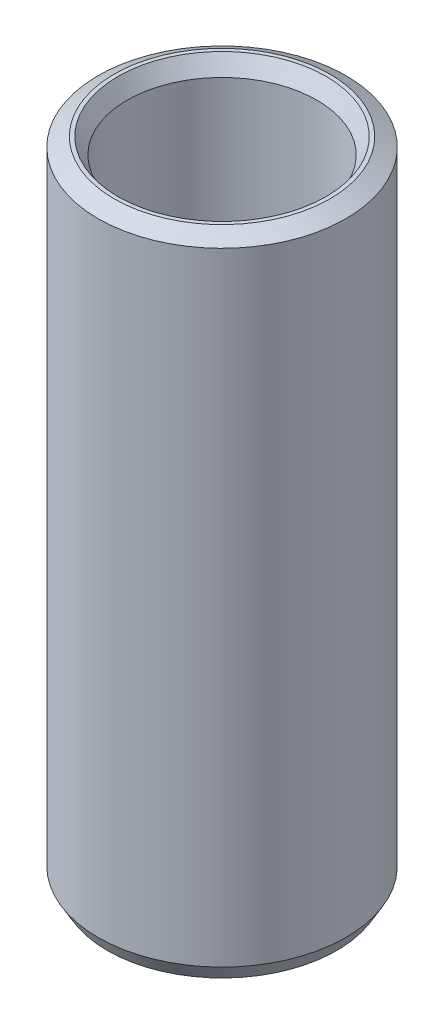
ISO-10303-21;
HEADER;
FILE_DESCRIPTION(('STEP AP214'),'2;1');
FILE_NAME('part.step','',(''),(''),'','','');
FILE_SCHEMA(('AUTOMOTIVE_DESIGN { 1 0 10303 214 1 1 1 1 }'));
ENDSEC;
DATA;
#1=APPLICATION_CONTEXT('core data for automotive mechanical design processes');
#2=APPLICATION_PROTOCOL_DEFINITION('international standard','automotive_design',2000,#1);
#3=PRODUCT_CONTEXT('',#1,'mechanical');
#4=PRODUCT('Part','Part','',(#3));
#5=PRODUCT_RELATED_PRODUCT_CATEGORY('part','',(#4));
#6=PRODUCT_DEFINITION_FORMATION('','',#4);
#7=PRODUCT_DEFINITION_CONTEXT('part definition',#1,'design');
#8=PRODUCT_DEFINITION('design','',#6,#7);
#9=PRODUCT_DEFINITION_SHAPE('','',#8);
#10=(LENGTH_UNIT() NAMED_UNIT(*) SI_UNIT(.MILLI.,.METRE.));
#11=(NAMED_UNIT(*) PLANE_ANGLE_UNIT() SI_UNIT($,.RADIAN.));
#12=(NAMED_UNIT(*) SI_UNIT($,.STERADIAN.) SOLID_ANGLE_UNIT());
#13=UNCERTAINTY_MEASURE_WITH_UNIT(LENGTH_MEASURE(1.E-05),#10,'distance_accuracy_value','');
#14=(GEOMETRIC_REPRESENTATION_CONTEXT(3) GLOBAL_UNCERTAINTY_ASSIGNED_CONTEXT((#13)) GLOBAL_UNIT_ASSIGNED_CONTEXT((#10,
#11,#12)) REPRESENTATION_CONTEXT('',''));
#15=CARTESIAN_POINT('',(0.,0.,0.));
#16=DIRECTION('',(0.,0.,1.));
#17=DIRECTION('',(1.,0.,0.));
#18=AXIS2_PLACEMENT_3D('',#15,#16,#17);
#19=CARTESIAN_POINT('',(0.,91.4530809849364,0.));
#20=DIRECTION('',(0.,-1.,0.));
#21=DIRECTION('',(0.,0.,-1.));
#22=AXIS2_PLACEMENT_3D('',#19,#20,#21);
#23=CYLINDRICAL_SURFACE('',#22,17.5);
#24=CARTESIAN_POINT('',(0.,2.25412344930789,0.));
#25=DIRECTION('',(0.,1.,0.));
#26=DIRECTION('',(0.,0.,1.));
#27=AXIS2_PLACEMENT_3D('',#24,#25,#26);
#28=CIRCLE('',#27,17.5);
#29=CARTESIAN_POINT('',(0.,2.25412344930789,17.5));
#30=VERTEX_POINT('',#29);
#31=EDGE_CURVE('E10',#30,#30,#28,.T.);
#32=ORIENTED_EDGE('',*,*,#31,.T.);
#33=EDGE_LOOP('',(#32));
#34=FACE_BOUND('',#33,.T.);
#35=CARTESIAN_POINT('',(0.,90.1516622046918,0.));
#36=DIRECTION('',(0.,1.,0.));
#37=DIRECTION('',(0.,0.,1.));
#38=AXIS2_PLACEMENT_3D('',#35,#36,#37);
#39=CIRCLE('',#38,17.5);
#40=CARTESIAN_POINT('',(0.,90.1516622046918,17.5));
#41=VERTEX_POINT('',#40);
#42=EDGE_CURVE('E50',#41,#41,#39,.F.);
#43=ORIENTED_EDGE('',*,*,#42,.T.);
#44=EDGE_LOOP('',(#43));
#45=FACE_BOUND('',#44,.T.);
#46=ADVANCED_FACE('F39',(#34,#45),#23,.T.);
#47=CARTESIAN_POINT('',(0.,91.4530809849364,0.));
#48=DIRECTION('',(0.,1.,0.));
#49=DIRECTION('',(0.,0.,1.));
#50=AXIS2_PLACEMENT_3D('',#47,#48,#49);
#51=PLANE('',#50);
#52=CARTESIAN_POINT('',(0.,91.4530809849364,0.));
#53=DIRECTION('',(0.,1.,0.));
#54=DIRECTION('',(0.,0.,1.));
#55=AXIS2_PLACEMENT_3D('',#52,#53,#54);
#56=CIRCLE('',#55,14.7026554656927);
#57=CARTESIAN_POINT('',(0.,91.4530809849364,14.7026554656927));
#58=VERTEX_POINT('',#57);
#59=EDGE_CURVE('E58',#58,#58,#56,.F.);
#60=ORIENTED_EDGE('',*,*,#59,.T.);
#61=EDGE_LOOP('',(#60));
#62=FACE_BOUND('',#61,.T.);
#63=CARTESIAN_POINT('',(0.,91.4530809849364,0.));
#64=DIRECTION('',(0.,1.,0.));
#65=DIRECTION('',(0.,0.,1.));
#66=AXIS2_PLACEMENT_3D('',#63,#64,#65);
#67=CIRCLE('',#66,15.2458765506922);
#68=CARTESIAN_POINT('',(0.,91.4530809849364,15.2458765506922));
#69=VERTEX_POINT('',#68);
#70=EDGE_CURVE('E61',#69,#69,#67,.T.);
#71=ORIENTED_EDGE('',*,*,#70,.T.);
#72=EDGE_LOOP('',(#71));
#73=FACE_BOUND('',#72,.T.);
#74=ADVANCED_FACE('F88',(#62,#73),#51,.T.);
#75=CARTESIAN_POINT('',(0.,0.,0.));
#76=DIRECTION('',(0.,1.,0.));
#77=DIRECTION('',(0.,0.,1.));
#78=AXIS2_PLACEMENT_3D('',#75,#76,#77);
#79=PLANE('',#78);
#80=CARTESIAN_POINT('',(0.,0.,0.));
#81=DIRECTION('',(0.,1.,0.));
#82=DIRECTION('',(0.,0.,1.));
#83=AXIS2_PLACEMENT_3D('',#80,#81,#82);
#84=CIRCLE('',#83,15.655360134756);
#85=CARTESIAN_POINT('',(0.,0.,15.655360134756));
#86=VERTEX_POINT('',#85);
#87=EDGE_CURVE('E51',#86,#86,#84,.T.);
#88=ORIENTED_EDGE('',*,*,#87,.T.);
#89=EDGE_LOOP('',(#88));
#90=FACE_BOUND('',#89,.T.);
#91=CARTESIAN_POINT('',(0.,0.,0.));
#92=DIRECTION('',(0.,1.,0.));
#93=DIRECTION('',(0.,0.,1.));
#94=AXIS2_PLACEMENT_3D('',#91,#92,#93);
#95=CIRCLE('',#94,16.1985812197554);
#96=CARTESIAN_POINT('',(0.,0.,16.1985812197554));
#97=VERTEX_POINT('',#96);
#98=EDGE_CURVE('E54',#97,#97,#95,.F.);
#99=ORIENTED_EDGE('',*,*,#98,.T.);
#100=EDGE_LOOP('',(#99));
#101=FACE_BOUND('',#100,.T.);
#102=ADVANCED_FACE('F83',(#90,#101),#79,.F.);
#103=CARTESIAN_POINT('',(0.,91.4530809849364,0.));
#104=DIRECTION('',(0.,-1.,0.));
#105=DIRECTION('',(0.,0.,-1.));
#106=AXIS2_PLACEMENT_3D('',#103,#104,#105);
#107=CYLINDRICAL_SURFACE('',#106,13.4012366854482);
#108=CARTESIAN_POINT('',(0.,89.1989575356285,0.));
#109=DIRECTION('',(0.,1.,0.));
#110=DIRECTION('',(0.,0.,1.));
#111=AXIS2_PLACEMENT_3D('',#108,#109,#110);
#112=CIRCLE('',#111,13.4012366854482);
#113=CARTESIAN_POINT('',(0.,89.1989575356285,13.4012366854482));
#114=VERTEX_POINT('',#113);
#115=EDGE_CURVE('E67',#114,#114,#112,.T.);
#116=ORIENTED_EDGE('',*,*,#115,.T.);
#117=EDGE_LOOP('',(#116));
#118=FACE_BOUND('',#117,.T.);
#119=CARTESIAN_POINT('',(0.,1.30141878024455,0.));
#120=DIRECTION('',(0.,1.,0.));
#121=DIRECTION('',(0.,0.,1.));
#122=AXIS2_PLACEMENT_3D('',#119,#120,#121);
#123=CIRCLE('',#122,13.4012366854482);
#124=CARTESIAN_POINT('',(0.,1.30141878024455,13.4012366854482));
#125=VERTEX_POINT('',#124);
#126=EDGE_CURVE('E69',#125,#125,#123,.F.);
#127=ORIENTED_EDGE('',*,*,#126,.T.);
#128=EDGE_LOOP('',(#127));
#129=FACE_BOUND('',#128,.T.);
#130=ADVANCED_FACE('F71',(#118,#129),#107,.F.);
#131=CARTESIAN_POINT('',(0.,89.1989575356285,0.));
#132=DIRECTION('',(0.,1.,0.));
#133=DIRECTION('',(0.,0.,1.));
#134=AXIS2_PLACEMENT_3D('',#131,#132,#133);
#135=CONICAL_SURFACE('',#134,13.4012366854482,0.523598775598298);
#136=ORIENTED_EDGE('',*,*,#59,.F.);
#137=EDGE_LOOP('',(#136));
#138=FACE_BOUND('',#137,.T.);
#139=ORIENTED_EDGE('',*,*,#115,.F.);
#140=EDGE_LOOP('',(#139));
#141=FACE_BOUND('',#140,.T.);
#142=ADVANCED_FACE('F77',(#138,#141),#135,.F.);
#143=CARTESIAN_POINT('',(0.,0.,0.));
#144=DIRECTION('',(0.,-1.,0.));
#145=DIRECTION('',(0.,0.,-1.));
#146=AXIS2_PLACEMENT_3D('',#143,#144,#145);
#147=CONICAL_SURFACE('',#146,15.655360134756,1.04719755119659);
#148=ORIENTED_EDGE('',*,*,#126,.F.);
#149=EDGE_LOOP('',(#148));
#150=FACE_BOUND('',#149,.T.);
#151=ORIENTED_EDGE('',*,*,#87,.F.);
#152=EDGE_LOOP('',(#151));
#153=FACE_BOUND('',#152,.T.);
#154=ADVANCED_FACE('F73',(#150,#153),#147,.F.);
#155=CARTESIAN_POINT('',(0.,2.25412344930789,0.));
#156=DIRECTION('',(0.,1.,0.));
#157=DIRECTION('',(0.,0.,1.));
#158=AXIS2_PLACEMENT_3D('',#155,#156,#157);
#159=CONICAL_SURFACE('',#158,17.5,0.523598775598301);
#160=ORIENTED_EDGE('',*,*,#98,.F.);
#161=EDGE_LOOP('',(#160));
#162=FACE_BOUND('',#161,.T.);
#163=ORIENTED_EDGE('',*,*,#31,.F.);
#164=EDGE_LOOP('',(#163));
#165=FACE_BOUND('',#164,.T.);
#166=ADVANCED_FACE('F76',(#162,#165),#159,.T.);
#167=CARTESIAN_POINT('',(0.,91.4530809849364,0.));
#168=DIRECTION('',(0.,-1.,0.));
#169=DIRECTION('',(0.,0.,-1.));
#170=AXIS2_PLACEMENT_3D('',#167,#168,#169);
#171=CONICAL_SURFACE('',#170,15.2458765506922,1.0471975511966);
#172=ORIENTED_EDGE('',*,*,#42,.F.);
#173=EDGE_LOOP('',(#172));
#174=FACE_BOUND('',#173,.T.);
#175=ORIENTED_EDGE('',*,*,#70,.F.);
#176=EDGE_LOOP('',(#175));
#177=FACE_BOUND('',#176,.T.);
#178=ADVANCED_FACE('F45',(#174,#177),#171,.T.);
#179=CLOSED_SHELL('',(#46,#74,#102,#130,#142,#154,#166,#178));
#180=MANIFOLD_SOLID_BREP('B2',#179);
#181=ADVANCED_BREP_SHAPE_REPRESENTATION('',(#18,#180),#14);
#182=SHAPE_DEFINITION_REPRESENTATION(#9,#181);
ENDSEC;
END-ISO-10303-21;
